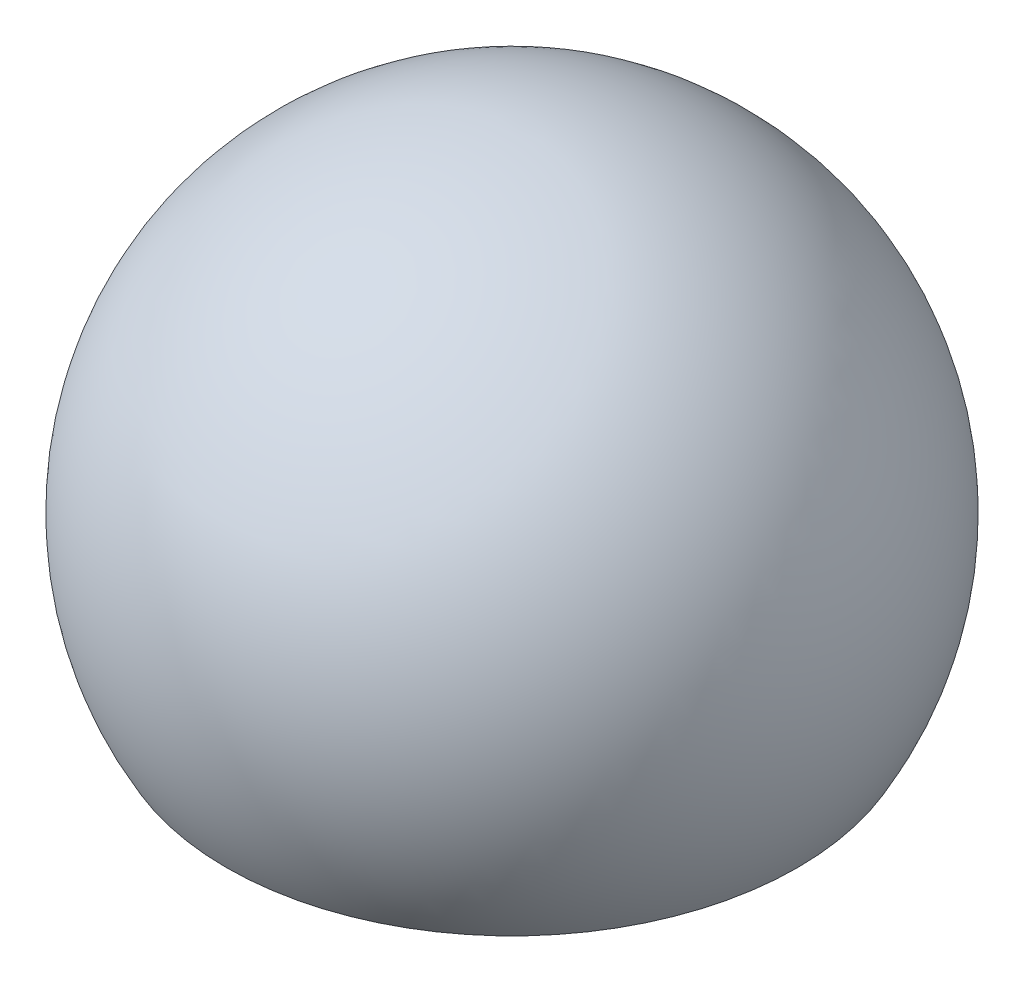
ISO-10303-21;
HEADER;
FILE_DESCRIPTION(('STEP AP214'),'2;1');
FILE_NAME('part.step','',(''),(''),'','','');
FILE_SCHEMA(('AUTOMOTIVE_DESIGN { 1 0 10303 214 1 1 1 1 }'));
ENDSEC;
DATA;
#1=APPLICATION_CONTEXT('core data for automotive mechanical design processes');
#2=APPLICATION_PROTOCOL_DEFINITION('international standard','automotive_design',2000,#1);
#3=PRODUCT_CONTEXT('',#1,'mechanical');
#4=PRODUCT('Part','Part','',(#3));
#5=PRODUCT_RELATED_PRODUCT_CATEGORY('part','',(#4));
#6=PRODUCT_DEFINITION_FORMATION('','',#4);
#7=PRODUCT_DEFINITION_CONTEXT('part definition',#1,'design');
#8=PRODUCT_DEFINITION('design','',#6,#7);
#9=PRODUCT_DEFINITION_SHAPE('','',#8);
#10=(LENGTH_UNIT() NAMED_UNIT(*) SI_UNIT(.MILLI.,.METRE.));
#11=(NAMED_UNIT(*) PLANE_ANGLE_UNIT() SI_UNIT($,.RADIAN.));
#12=(NAMED_UNIT(*) SI_UNIT($,.STERADIAN.) SOLID_ANGLE_UNIT());
#13=UNCERTAINTY_MEASURE_WITH_UNIT(LENGTH_MEASURE(1.E-05),#10,'distance_accuracy_value','');
#14=(GEOMETRIC_REPRESENTATION_CONTEXT(3) GLOBAL_UNCERTAINTY_ASSIGNED_CONTEXT((#13)) GLOBAL_UNIT_ASSIGNED_CONTEXT((#10,
#11,#12)) REPRESENTATION_CONTEXT('',''));
#15=CARTESIAN_POINT('',(0.,0.,0.));
#16=DIRECTION('',(0.,0.,1.));
#17=DIRECTION('',(1.,0.,0.));
#18=AXIS2_PLACEMENT_3D('',#15,#16,#17);
#19=CARTESIAN_POINT('',(-10.9985226280624,-6.35,-12.7));
#20=DIRECTION('',(0.,1.,0.));
#21=DIRECTION('',(0.,0.,1.));
#22=AXIS2_PLACEMENT_3D('',#19,#20,#21);
#23=PLANE('',#22);
#24=CARTESIAN_POINT('',(0.,-6.35,0.));
#25=DIRECTION('',(0.,1.,0.));
#26=DIRECTION('',(0.,0.,1.));
#27=AXIS2_PLACEMENT_3D('',#24,#25,#26);
#28=CIRCLE('',#27,10.9985226280624);
#29=CARTESIAN_POINT('',(0.,-6.35,10.9985226280624));
#30=VERTEX_POINT('',#29);
#31=EDGE_CURVE('E10',#30,#30,#28,.T.);
#32=ORIENTED_EDGE('',*,*,#31,.F.);
#33=EDGE_LOOP('',(#32));
#34=FACE_BOUND('',#33,.T.);
#35=CARTESIAN_POINT('',(0.,-6.35,0.));
#36=DIRECTION('',(0.,1.,0.));
#37=DIRECTION('',(0.,0.,1.));
#38=AXIS2_PLACEMENT_3D('',#35,#36,#37);
#39=CIRCLE('',#38,1.5875);
#40=CARTESIAN_POINT('',(0.,-6.35,1.5875));
#41=VERTEX_POINT('',#40);
#42=EDGE_CURVE('E35',#41,#41,#39,.F.);
#43=ORIENTED_EDGE('',*,*,#42,.F.);
#44=EDGE_LOOP('',(#43));
#45=FACE_BOUND('',#44,.T.);
#46=ADVANCED_FACE('F31',(#34,#45),#23,.F.);
#47=CARTESIAN_POINT('',(0.,0.,0.));
#48=DIRECTION('',(0.,1.,0.));
#49=DIRECTION('',(1.,0.,0.));
#50=AXIS2_PLACEMENT_3D('',#47,#48,#49);
#51=SPHERICAL_SURFACE('',#50,12.7);
#52=ORIENTED_EDGE('',*,*,#31,.T.);
#53=EDGE_LOOP('',(#52));
#54=FACE_BOUND('',#53,.T.);
#55=ADVANCED_FACE('F33',(#54),#51,.T.);
#56=CARTESIAN_POINT('',(0.,6.7268980432964,0.));
#57=DIRECTION('',(0.,1.,0.));
#58=DIRECTION('',(0.,0.,1.));
#59=AXIS2_PLACEMENT_3D('',#56,#57,#58);
#60=CYLINDRICAL_SURFACE('',#59,1.5875);
#61=CARTESIAN_POINT('',(0.,-1.5875,0.));
#62=DIRECTION('',(0.,1.,0.));
#63=DIRECTION('',(0.,0.,1.));
#64=AXIS2_PLACEMENT_3D('',#61,#62,#63);
#65=CIRCLE('',#64,1.5875);
#66=CARTESIAN_POINT('',(0.,-1.5875,1.5875));
#67=VERTEX_POINT('',#66);
#68=EDGE_CURVE('E42',#67,#67,#65,.T.);
#69=ORIENTED_EDGE('',*,*,#68,.T.);
#70=EDGE_LOOP('',(#69));
#71=FACE_BOUND('',#70,.T.);
#72=ORIENTED_EDGE('',*,*,#42,.T.);
#73=EDGE_LOOP('',(#72));
#74=FACE_BOUND('',#73,.T.);
#75=ADVANCED_FACE('F47',(#71,#74),#60,.F.);
#76=CARTESIAN_POINT('',(1.5875,-1.5875,0.));
#77=DIRECTION('',(0.,-1.,0.));
#78=DIRECTION('',(0.,0.,-1.));
#79=AXIS2_PLACEMENT_3D('',#76,#77,#78);
#80=PLANE('',#79);
#81=ORIENTED_EDGE('',*,*,#68,.F.);
#82=EDGE_LOOP('',(#81));
#83=FACE_BOUND('',#82,.T.);
#84=ADVANCED_FACE('F50',(#83),#80,.T.);
#85=CLOSED_SHELL('',(#46,#55,#75,#84));
#86=MANIFOLD_SOLID_BREP('B2',#85);
#87=ADVANCED_BREP_SHAPE_REPRESENTATION('',(#18,#86),#14);
#88=SHAPE_DEFINITION_REPRESENTATION(#9,#87);
ENDSEC;
END-ISO-10303-21;
